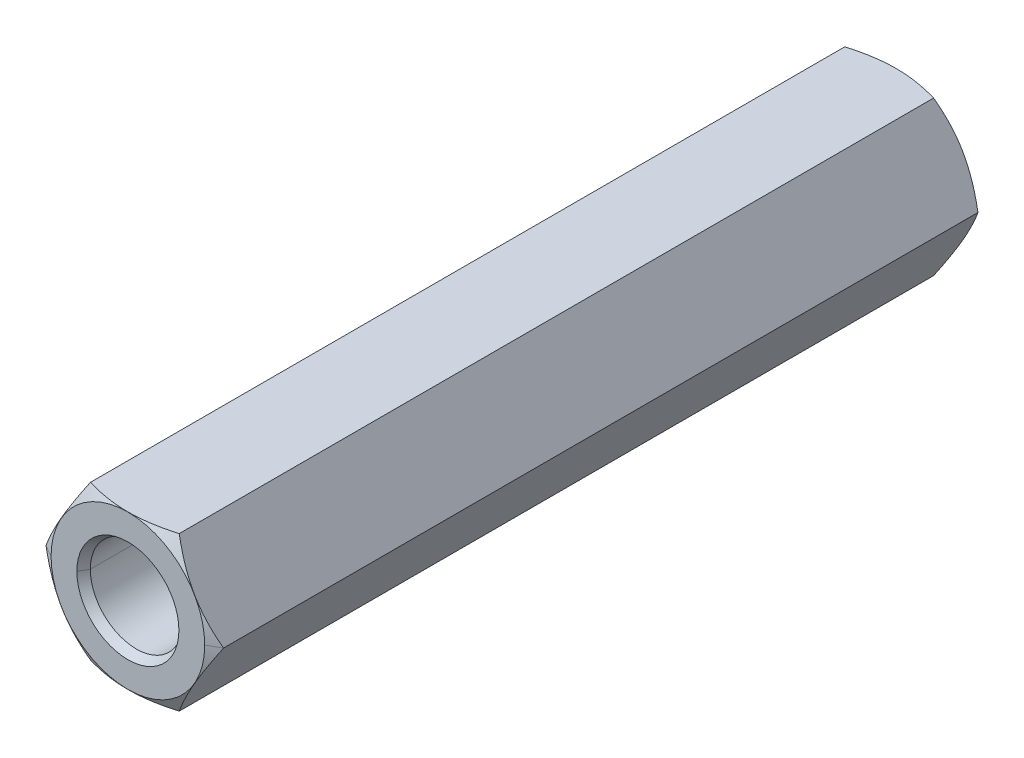
ISO-10303-21;
HEADER;
FILE_DESCRIPTION(('STEP AP214'),'2;1');
FILE_NAME('part.step','',(''),(''),'','','');
FILE_SCHEMA(('AUTOMOTIVE_DESIGN { 1 0 10303 214 1 1 1 1 }'));
ENDSEC;
DATA;
#1=APPLICATION_CONTEXT('core data for automotive mechanical design processes');
#2=APPLICATION_PROTOCOL_DEFINITION('international standard','automotive_design',2000,#1);
#3=PRODUCT_CONTEXT('',#1,'mechanical');
#4=PRODUCT('Part','Part','',(#3));
#5=PRODUCT_RELATED_PRODUCT_CATEGORY('part','',(#4));
#6=PRODUCT_DEFINITION_FORMATION('','',#4);
#7=PRODUCT_DEFINITION_CONTEXT('part definition',#1,'design');
#8=PRODUCT_DEFINITION('design','',#6,#7);
#9=PRODUCT_DEFINITION_SHAPE('','',#8);
#10=(LENGTH_UNIT() NAMED_UNIT(*) SI_UNIT(.MILLI.,.METRE.));
#11=(NAMED_UNIT(*) PLANE_ANGLE_UNIT() SI_UNIT($,.RADIAN.));
#12=(NAMED_UNIT(*) SI_UNIT($,.STERADIAN.) SOLID_ANGLE_UNIT());
#13=UNCERTAINTY_MEASURE_WITH_UNIT(LENGTH_MEASURE(1.E-05),#10,'distance_accuracy_value','');
#14=(GEOMETRIC_REPRESENTATION_CONTEXT(3) GLOBAL_UNCERTAINTY_ASSIGNED_CONTEXT((#13)) GLOBAL_UNIT_ASSIGNED_CONTEXT((#10,
#11,#12)) REPRESENTATION_CONTEXT('',''));
#15=CARTESIAN_POINT('',(0.,0.,0.));
#16=DIRECTION('',(0.,0.,1.));
#17=DIRECTION('',(1.,0.,0.));
#18=AXIS2_PLACEMENT_3D('',#15,#16,#17);
#19=CARTESIAN_POINT('',(116.318744279938,128.56204329235,150.447608312383));
#20=DIRECTION('',(0.,0.,-1.));
#21=DIRECTION('',(1.,0.,0.));
#22=AXIS2_PLACEMENT_3D('',#19,#20,#21);
#23=CONICAL_SURFACE('',#22,1.73205080757048,1.047197551197);
#24=DIRECTION('',(0.86602540378464,0.,-0.499999999999652));
#25=VECTOR('',#24,1.);
#26=CARTESIAN_POINT('',(118.050795087508,128.56204329235,150.447608312383));
#27=LINE('',#26,#25);
#28=CARTESIAN_POINT('',(116.318744279938,128.56204329235,151.447608312383));
#29=VERTEX_POINT('',#28);
#30=CARTESIAN_POINT('',(117.818744279938,128.56204329235,150.581582908599));
#31=VERTEX_POINT('',#30);
#32=EDGE_CURVE('E69',#29,#31,#27,.T.);
#33=ORIENTED_EDGE('',*,*,#32,.F.);
#34=DIRECTION('',(-0.86602540378464,0.,-0.499999999999652));
#35=VECTOR('',#34,1.);
#36=CARTESIAN_POINT('',(114.586693472367,128.56204329235,150.447608312383));
#37=LINE('',#36,#35);
#38=CARTESIAN_POINT('',(114.818744279938,128.56204329235,150.581582908599));
#39=VERTEX_POINT('',#38);
#40=EDGE_CURVE('E11',#29,#39,#37,.T.);
#41=ORIENTED_EDGE('',*,*,#40,.T.);
#42=CARTESIAN_POINT('',(116.318744279938,128.56204329235,150.581582908599));
#43=DIRECTION('',(0.,0.,1.));
#44=DIRECTION('',(1.,0.,0.));
#45=AXIS2_PLACEMENT_3D('',#42,#43,#44);
#46=CIRCLE('',#45,1.5);
#47=EDGE_CURVE('E57',#31,#39,#46,.T.);
#48=ORIENTED_EDGE('',*,*,#47,.F.);
#49=EDGE_LOOP('',(#33,#41,#48));
#50=FACE_BOUND('',#49,.T.);
#51=ADVANCED_FACE('F44',(#50),#23,.F.);
#52=CARTESIAN_POINT('',(116.318744279938,128.56204329235,150.581582908599));
#53=DIRECTION('',(0.,0.,-1.));
#54=DIRECTION('',(1.,0.,0.));
#55=AXIS2_PLACEMENT_3D('',#52,#53,#54);
#56=CYLINDRICAL_SURFACE('',#55,1.5);
#57=ORIENTED_EDGE('',*,*,#47,.T.);
#58=DIRECTION('',(0.,0.,-1.));
#59=VECTOR('',#58,1.);
#60=CARTESIAN_POINT('',(114.818744279938,128.56204329235,150.581582908599));
#61=LINE('',#60,#59);
#62=CARTESIAN_POINT('',(114.818744279938,128.56204329235,140.858711037809));
#63=VERTEX_POINT('',#62);
#64=EDGE_CURVE('E330',#39,#63,#61,.T.);
#65=ORIENTED_EDGE('',*,*,#64,.T.);
#66=CARTESIAN_POINT('',(116.318744279938,128.56204329235,140.858711037809));
#67=DIRECTION('',(0.,0.,1.));
#68=DIRECTION('',(1.,0.,0.));
#69=AXIS2_PLACEMENT_3D('',#66,#67,#68);
#70=CIRCLE('',#69,1.5);
#71=CARTESIAN_POINT('',(117.818744279938,128.56204329235,140.858711037809));
#72=VERTEX_POINT('',#71);
#73=EDGE_CURVE('E343',#72,#63,#70,.T.);
#74=ORIENTED_EDGE('',*,*,#73,.F.);
#75=DIRECTION('',(0.,0.,-1.));
#76=VECTOR('',#75,1.);
#77=CARTESIAN_POINT('',(117.818744279938,128.56204329235,150.581582908599));
#78=LINE('',#77,#76);
#79=EDGE_CURVE('E295',#31,#72,#78,.T.);
#80=ORIENTED_EDGE('',*,*,#79,.F.);
#81=EDGE_LOOP('',(#57,#65,#74,#80));
#82=FACE_BOUND('',#81,.T.);
#83=ADVANCED_FACE('F490',(#82),#56,.F.);
#84=CARTESIAN_POINT('',(116.318744279938,128.56204329235,140.858711037809));
#85=DIRECTION('',(0.,0.,-1.));
#86=DIRECTION('',(1.,0.,0.));
#87=AXIS2_PLACEMENT_3D('',#84,#85,#86);
#88=CONICAL_SURFACE('',#87,1.5,0.5235987756);
#89=ORIENTED_EDGE('',*,*,#73,.T.);
#90=DIRECTION('',(-0.500000000001473,0.,-0.866025403783588));
#91=VECTOR('',#90,1.);
#92=CARTESIAN_POINT('',(114.818744279938,128.56204329235,140.858711037809));
#93=LINE('',#92,#91);
#94=CARTESIAN_POINT('',(114.658744279938,128.56204329235,140.581582908599));
#95=VERTEX_POINT('',#94);
#96=EDGE_CURVE('E269',#63,#95,#93,.T.);
#97=ORIENTED_EDGE('',*,*,#96,.T.);
#98=CARTESIAN_POINT('',(116.318744279938,128.56204329235,140.581582908599));
#99=DIRECTION('',(0.,0.,1.));
#100=DIRECTION('',(1.,0.,0.));
#101=AXIS2_PLACEMENT_3D('',#98,#99,#100);
#102=CIRCLE('',#101,1.66);
#103=CARTESIAN_POINT('',(117.978744279938,128.56204329235,140.581582908599));
#104=VERTEX_POINT('',#103);
#105=EDGE_CURVE('E199',#104,#95,#102,.T.);
#106=ORIENTED_EDGE('',*,*,#105,.F.);
#107=DIRECTION('',(0.500000000001473,0.,-0.866025403783588));
#108=VECTOR('',#107,1.);
#109=CARTESIAN_POINT('',(117.818744279938,128.56204329235,140.858711037809));
#110=LINE('',#109,#108);
#111=EDGE_CURVE('E222',#72,#104,#110,.T.);
#112=ORIENTED_EDGE('',*,*,#111,.F.);
#113=EDGE_LOOP('',(#89,#97,#106,#112));
#114=FACE_BOUND('',#113,.T.);
#115=ADVANCED_FACE('F495',(#114),#88,.F.);
#116=CARTESIAN_POINT('',(116.318744279938,128.56204329235,140.581582908599));
#117=DIRECTION('',(0.,0.,1.));
#118=DIRECTION('',(1.,0.,0.));
#119=AXIS2_PLACEMENT_3D('',#116,#117,#118);
#120=CONICAL_SURFACE('',#119,2.5,1.047197551197);
#121=CARTESIAN_POINT('',(116.318744279938,128.56204329235,140.581582908599));
#122=DIRECTION('',(0.,0.,1.));
#123=DIRECTION('',(1.,0.,0.));
#124=AXIS2_PLACEMENT_3D('',#121,#122,#123);
#125=CIRCLE('',#124,2.5);
#126=CARTESIAN_POINT('',(118.818744279938,128.56204329235,140.581582908599));
#127=VERTEX_POINT('',#126);
#128=CARTESIAN_POINT('',(113.818744279938,128.56204329235,140.581582908599));
#129=VERTEX_POINT('',#128);
#130=EDGE_CURVE('E265',#127,#129,#125,.T.);
#131=ORIENTED_EDGE('',*,*,#130,.T.);
#132=DIRECTION('',(-0.86602540378464,0.,0.499999999999652));
#133=VECTOR('',#132,1.);
#134=CARTESIAN_POINT('',(113.818744279938,128.56204329235,140.581582908599));
#135=LINE('',#134,#133);
#136=CARTESIAN_POINT('',(113.428744279938,128.56204329235,140.806749513583));
#137=VERTEX_POINT('',#136);
#138=EDGE_CURVE('E270',#129,#137,#135,.T.);
#139=ORIENTED_EDGE('',*,*,#138,.T.);
#140=CARTESIAN_POINT('',(114.873744279938,131.064856709287,140.806749513583));
#141=CARTESIAN_POINT('',(114.151244279938,129.813450000819,140.389613944093));
#142=CARTESIAN_POINT('',(113.428744279938,128.56204329235,140.806749513583));
#143=(BOUNDED_CURVE() B_SPLINE_CURVE(2,(#140,#141,#142),.UNSPECIFIED.,.F.,
.F.) B_SPLINE_CURVE_WITH_KNOTS((3,3),(0.,1.),
.UNSPECIFIED.) CURVE() GEOMETRIC_REPRESENTATION_ITEM() RATIONAL_B_SPLINE_CURVE((1.,
1.15470053837935,1.)) REPRESENTATION_ITEM(''));
#144=CARTESIAN_POINT('',(114.873744279938,131.064856709287,140.806749513583));
#145=VERTEX_POINT('',#144);
#146=EDGE_CURVE('E271',#145,#137,#143,.T.);
#147=ORIENTED_EDGE('',*,*,#146,.F.);
#148=CARTESIAN_POINT('',(117.763744279938,131.064856709287,140.806749513583));
#149=CARTESIAN_POINT('',(116.318744279938,131.064856709288,140.389613944093));
#150=CARTESIAN_POINT('',(114.873744279938,131.064856709287,140.806749513583));
#151=(BOUNDED_CURVE() B_SPLINE_CURVE(2,(#148,#149,#150),.UNSPECIFIED.,.F.,
.F.) B_SPLINE_CURVE_WITH_KNOTS((3,3),(0.,1.),
.UNSPECIFIED.) CURVE() GEOMETRIC_REPRESENTATION_ITEM() RATIONAL_B_SPLINE_CURVE((1.,
1.15470053837926,1.)) REPRESENTATION_ITEM(''));
#152=CARTESIAN_POINT('',(117.763744279938,131.064856709287,140.806749513583));
#153=VERTEX_POINT('',#152);
#154=EDGE_CURVE('E48',#153,#145,#151,.T.);
#155=ORIENTED_EDGE('',*,*,#154,.F.);
#156=CARTESIAN_POINT('',(119.208744279938,128.56204329235,140.806749513583));
#157=CARTESIAN_POINT('',(118.486244279938,129.813450000819,140.389613944093));
#158=CARTESIAN_POINT('',(117.763744279938,131.064856709287,140.806749513583));
#159=(BOUNDED_CURVE() B_SPLINE_CURVE(2,(#156,#157,#158),.UNSPECIFIED.,.F.,
.F.) B_SPLINE_CURVE_WITH_KNOTS((3,3),(0.,1.),
.UNSPECIFIED.) CURVE() GEOMETRIC_REPRESENTATION_ITEM() RATIONAL_B_SPLINE_CURVE((1.,
1.15470053837946,1.)) REPRESENTATION_ITEM(''));
#160=CARTESIAN_POINT('',(119.208744279938,128.56204329235,140.806749513583));
#161=VERTEX_POINT('',#160);
#162=EDGE_CURVE('E248',#161,#153,#159,.T.);
#163=ORIENTED_EDGE('',*,*,#162,.F.);
#164=DIRECTION('',(0.86602540378464,0.,0.499999999999652));
#165=VECTOR('',#164,1.);
#166=CARTESIAN_POINT('',(118.818744279938,128.56204329235,140.581582908599));
#167=LINE('',#166,#165);
#168=EDGE_CURVE('E189',#127,#161,#167,.T.);
#169=ORIENTED_EDGE('',*,*,#168,.F.);
#170=EDGE_LOOP('',(#131,#139,#147,#155,#163,#169));
#171=FACE_BOUND('',#170,.T.);
#172=ADVANCED_FACE('F470',(#171),#120,.T.);
#173=CARTESIAN_POINT('',(116.318744279938,128.56204329235,165.356416303615));
#174=DIRECTION('',(0.,0.,-1.));
#175=DIRECTION('',(1.,0.,0.));
#176=AXIS2_PLACEMENT_3D('',#173,#174,#175);
#177=CONICAL_SURFACE('',#176,2.89,1.047197551197);
#178=CARTESIAN_POINT('',(116.318744279938,128.56204329235,165.581582908599));
#179=DIRECTION('',(0.,0.,1.));
#180=DIRECTION('',(1.,0.,0.));
#181=AXIS2_PLACEMENT_3D('',#178,#179,#180);
#182=CIRCLE('',#181,2.5);
#183=CARTESIAN_POINT('',(113.818744279938,128.56204329235,165.581582908599));
#184=VERTEX_POINT('',#183);
#185=CARTESIAN_POINT('',(118.818744279938,128.56204329235,165.581582908599));
#186=VERTEX_POINT('',#185);
#187=EDGE_CURVE('E263',#184,#186,#182,.T.);
#188=ORIENTED_EDGE('',*,*,#187,.F.);
#189=DIRECTION('',(-0.86602540378464,0.,-0.499999999999652));
#190=VECTOR('',#189,1.);
#191=CARTESIAN_POINT('',(113.428744279938,128.56204329235,165.356416303615));
#192=LINE('',#191,#190);
#193=CARTESIAN_POINT('',(113.428744279938,128.56204329235,165.356416303615));
#194=VERTEX_POINT('',#193);
#195=EDGE_CURVE('E195',#184,#194,#192,.T.);
#196=ORIENTED_EDGE('',*,*,#195,.T.);
#197=CARTESIAN_POINT('',(114.873744279938,126.059229875413,165.356416303615));
#198=CARTESIAN_POINT('',(114.151244279938,127.310636583881,165.773551873104));
#199=CARTESIAN_POINT('',(113.428744279938,128.56204329235,165.356416303615));
#200=(BOUNDED_CURVE() B_SPLINE_CURVE(2,(#197,#198,#199),.UNSPECIFIED.,.F.,
.F.) B_SPLINE_CURVE_WITH_KNOTS((3,3),(0.,1.),
.UNSPECIFIED.) CURVE() GEOMETRIC_REPRESENTATION_ITEM() RATIONAL_B_SPLINE_CURVE((1.,
1.15470053837936,1.)) REPRESENTATION_ITEM(''));
#201=CARTESIAN_POINT('',(114.873744279938,126.059229875413,165.356416303615));
#202=VERTEX_POINT('',#201);
#203=EDGE_CURVE('E158',#202,#194,#200,.T.);
#204=ORIENTED_EDGE('',*,*,#203,.F.);
#205=CARTESIAN_POINT('',(117.763744279938,126.059229875413,165.356416303615));
#206=CARTESIAN_POINT('',(116.318744279938,126.059229875413,165.773551873104));
#207=CARTESIAN_POINT('',(114.873744279938,126.059229875413,165.356416303615));
#208=(BOUNDED_CURVE() B_SPLINE_CURVE(2,(#205,#206,#207),.UNSPECIFIED.,.F.,
.F.) B_SPLINE_CURVE_WITH_KNOTS((3,3),(0.,1.),
.UNSPECIFIED.) CURVE() GEOMETRIC_REPRESENTATION_ITEM() RATIONAL_B_SPLINE_CURVE((1.,
1.15470053837925,1.)) REPRESENTATION_ITEM(''));
#209=CARTESIAN_POINT('',(117.763744279938,126.059229875413,165.356416303615));
#210=VERTEX_POINT('',#209);
#211=EDGE_CURVE('E153',#210,#202,#208,.T.);
#212=ORIENTED_EDGE('',*,*,#211,.F.);
#213=CARTESIAN_POINT('',(119.208744279938,128.56204329235,165.356416303615));
#214=CARTESIAN_POINT('',(118.486244279938,127.310636583882,165.773551873105));
#215=CARTESIAN_POINT('',(117.763744279938,126.059229875413,165.356416303615));
#216=(BOUNDED_CURVE() B_SPLINE_CURVE(2,(#213,#214,#215),.UNSPECIFIED.,.F.,
.F.) B_SPLINE_CURVE_WITH_KNOTS((3,3),(0.,1.),
.UNSPECIFIED.) CURVE() GEOMETRIC_REPRESENTATION_ITEM() RATIONAL_B_SPLINE_CURVE((1.,
1.15470053837944,1.)) REPRESENTATION_ITEM(''));
#217=CARTESIAN_POINT('',(119.208744279938,128.56204329235,165.356416303615));
#218=VERTEX_POINT('',#217);
#219=EDGE_CURVE('E231',#218,#210,#216,.T.);
#220=ORIENTED_EDGE('',*,*,#219,.F.);
#221=DIRECTION('',(0.86602540378464,0.,-0.499999999999652));
#222=VECTOR('',#221,1.);
#223=CARTESIAN_POINT('',(119.208744279938,128.56204329235,165.356416303615));
#224=LINE('',#223,#222);
#225=EDGE_CURVE('E256',#186,#218,#224,.T.);
#226=ORIENTED_EDGE('',*,*,#225,.F.);
#227=EDGE_LOOP('',(#188,#196,#204,#212,#220,#226));
#228=FACE_BOUND('',#227,.T.);
#229=ADVANCED_FACE('F530',(#228),#177,.T.);
#230=CARTESIAN_POINT('',(116.318744279938,128.56204329235,165.581582908599));
#231=DIRECTION('',(0.,0.,1.));
#232=DIRECTION('',(1.,0.,0.));
#233=AXIS2_PLACEMENT_3D('',#230,#231,#232);
#234=CONICAL_SURFACE('',#233,1.65999999999899,0.523598775598);
#235=CARTESIAN_POINT('',(116.318744279938,128.56204329235,165.304454779388));
#236=DIRECTION('',(0.,0.,1.));
#237=DIRECTION('',(1.,0.,0.));
#238=AXIS2_PLACEMENT_3D('',#235,#236,#237);
#239=CIRCLE('',#238,1.5);
#240=CARTESIAN_POINT('',(114.818744279938,128.56204329235,165.304454779388));
#241=VERTEX_POINT('',#240);
#242=CARTESIAN_POINT('',(117.818744279938,128.56204329235,165.304454779388));
#243=VERTEX_POINT('',#242);
#244=EDGE_CURVE('E344',#241,#243,#239,.T.);
#245=ORIENTED_EDGE('',*,*,#244,.F.);
#246=DIRECTION('',(-0.499999999999741,0.,0.866025403784588));
#247=VECTOR('',#246,1.);
#248=CARTESIAN_POINT('',(114.658744279939,128.56204329235,165.581582908599));
#249=LINE('',#248,#247);
#250=CARTESIAN_POINT('',(114.658744279939,128.56204329235,165.581582908599));
#251=VERTEX_POINT('',#250);
#252=EDGE_CURVE('E190',#241,#251,#249,.T.);
#253=ORIENTED_EDGE('',*,*,#252,.T.);
#254=CARTESIAN_POINT('',(116.318744279938,128.56204329235,165.581582908599));
#255=DIRECTION('',(0.,0.,1.));
#256=DIRECTION('',(1.,0.,0.));
#257=AXIS2_PLACEMENT_3D('',#254,#255,#256);
#258=CIRCLE('',#257,1.65999999999899);
#259=CARTESIAN_POINT('',(117.978744279937,128.56204329235,165.581582908599));
#260=VERTEX_POINT('',#259);
#261=EDGE_CURVE('E196',#251,#260,#258,.T.);
#262=ORIENTED_EDGE('',*,*,#261,.T.);
#263=DIRECTION('',(0.499999999999741,0.,0.866025403784588));
#264=VECTOR('',#263,1.);
#265=CARTESIAN_POINT('',(117.978744279937,128.56204329235,165.581582908599));
#266=LINE('',#265,#264);
#267=EDGE_CURVE('E233',#243,#260,#266,.T.);
#268=ORIENTED_EDGE('',*,*,#267,.F.);
#269=EDGE_LOOP('',(#245,#253,#262,#268));
#270=FACE_BOUND('',#269,.T.);
#271=ADVANCED_FACE('F528',(#270),#234,.F.);
#272=CARTESIAN_POINT('',(116.318744279938,128.56204329235,165.304454779388));
#273=DIRECTION('',(0.,0.,-1.));
#274=DIRECTION('',(1.,0.,0.));
#275=AXIS2_PLACEMENT_3D('',#272,#273,#274);
#276=CYLINDRICAL_SURFACE('',#275,1.5);
#277=CARTESIAN_POINT('',(116.318744279938,128.56204329235,165.304454779388));
#278=DIRECTION('',(0.,0.,1.));
#279=DIRECTION('',(1.,0.,0.));
#280=AXIS2_PLACEMENT_3D('',#277,#278,#279);
#281=CIRCLE('',#280,1.5);
#282=EDGE_CURVE('E352',#243,#241,#281,.T.);
#283=ORIENTED_EDGE('',*,*,#282,.T.);
#284=DIRECTION('',(0.,0.,-1.));
#285=VECTOR('',#284,1.);
#286=CARTESIAN_POINT('',(114.818744279938,128.56204329235,165.304454779388));
#287=LINE('',#286,#285);
#288=CARTESIAN_POINT('',(114.818744279938,128.56204329235,155.581582908599));
#289=VERTEX_POINT('',#288);
#290=EDGE_CURVE('E226',#241,#289,#287,.T.);
#291=ORIENTED_EDGE('',*,*,#290,.T.);
#292=CARTESIAN_POINT('',(116.318744279938,128.56204329235,155.581582908599));
#293=DIRECTION('',(0.,0.,1.));
#294=DIRECTION('',(1.,0.,0.));
#295=AXIS2_PLACEMENT_3D('',#292,#293,#294);
#296=CIRCLE('',#295,1.5);
#297=CARTESIAN_POINT('',(117.818744279938,128.56204329235,155.581582908599));
#298=VERTEX_POINT('',#297);
#299=EDGE_CURVE('E348',#298,#289,#296,.T.);
#300=ORIENTED_EDGE('',*,*,#299,.F.);
#301=DIRECTION('',(0.,0.,-1.));
#302=VECTOR('',#301,1.);
#303=CARTESIAN_POINT('',(117.818744279938,128.56204329235,165.304454779388));
#304=LINE('',#303,#302);
#305=EDGE_CURVE('E240',#243,#298,#304,.T.);
#306=ORIENTED_EDGE('',*,*,#305,.F.);
#307=EDGE_LOOP('',(#283,#291,#300,#306));
#308=FACE_BOUND('',#307,.T.);
#309=ADVANCED_FACE('F46',(#308),#276,.F.);
#310=CARTESIAN_POINT('',(116.318744279938,128.56204329235,155.581582908599));
#311=DIRECTION('',(0.,0.,1.));
#312=DIRECTION('',(1.,0.,0.));
#313=AXIS2_PLACEMENT_3D('',#310,#311,#312);
#314=CONICAL_SURFACE('',#313,1.5,1.047197551197);
#315=DIRECTION('',(0.86602540378464,0.,0.499999999999652));
#316=VECTOR('',#315,1.);
#317=CARTESIAN_POINT('',(117.818744279938,128.56204329235,155.581582908599));
#318=LINE('',#317,#316);
#319=CARTESIAN_POINT('',(116.318744279938,128.56204329235,154.715557504813));
#320=VERTEX_POINT('',#319);
#321=EDGE_CURVE('E318',#320,#298,#318,.T.);
#322=ORIENTED_EDGE('',*,*,#321,.F.);
#323=DIRECTION('',(-0.86602540378464,0.,0.499999999999652));
#324=VECTOR('',#323,1.);
#325=CARTESIAN_POINT('',(114.818744279938,128.56204329235,155.581582908599));
#326=LINE('',#325,#324);
#327=EDGE_CURVE('E317',#320,#289,#326,.T.);
#328=ORIENTED_EDGE('',*,*,#327,.T.);
#329=CARTESIAN_POINT('',(116.318744279938,128.56204329235,155.581582908599));
#330=DIRECTION('',(0.,0.,1.));
#331=DIRECTION('',(1.,0.,0.));
#332=AXIS2_PLACEMENT_3D('',#329,#330,#331);
#333=CIRCLE('',#332,1.5);
#334=EDGE_CURVE('E313',#289,#298,#333,.T.);
#335=ORIENTED_EDGE('',*,*,#334,.T.);
#336=EDGE_LOOP('',(#322,#328,#335));
#337=FACE_BOUND('',#336,.T.);
#338=ADVANCED_FACE('F400',(#337),#314,.F.);
#339=CARTESIAN_POINT('',(116.318744279938,128.56204329235,155.581582908599));
#340=DIRECTION('',(0.,0.,1.));
#341=DIRECTION('',(1.,0.,0.));
#342=AXIS2_PLACEMENT_3D('',#339,#340,#341);
#343=CONICAL_SURFACE('',#342,1.5,1.047197551197);
#344=ORIENTED_EDGE('',*,*,#327,.F.);
#345=ORIENTED_EDGE('',*,*,#321,.T.);
#346=ORIENTED_EDGE('',*,*,#299,.T.);
#347=EDGE_LOOP('',(#344,#345,#346));
#348=FACE_BOUND('',#347,.T.);
#349=ADVANCED_FACE('F394',(#348),#343,.F.);
#350=CARTESIAN_POINT('',(116.318744279938,128.56204329235,165.304454779388));
#351=DIRECTION('',(0.,0.,-1.));
#352=DIRECTION('',(1.,0.,0.));
#353=AXIS2_PLACEMENT_3D('',#350,#351,#352);
#354=CYLINDRICAL_SURFACE('',#353,1.5);
#355=ORIENTED_EDGE('',*,*,#290,.F.);
#356=ORIENTED_EDGE('',*,*,#244,.T.);
#357=ORIENTED_EDGE('',*,*,#305,.T.);
#358=ORIENTED_EDGE('',*,*,#334,.F.);
#359=EDGE_LOOP('',(#355,#356,#357,#358));
#360=FACE_BOUND('',#359,.T.);
#361=ADVANCED_FACE('F404',(#360),#354,.F.);
#362=CARTESIAN_POINT('',(116.318744279938,128.56204329235,165.581582908599));
#363=DIRECTION('',(0.,0.,1.));
#364=DIRECTION('',(1.,0.,0.));
#365=AXIS2_PLACEMENT_3D('',#362,#363,#364);
#366=CONICAL_SURFACE('',#365,1.65999999999899,0.523598775598);
#367=ORIENTED_EDGE('',*,*,#252,.F.);
#368=ORIENTED_EDGE('',*,*,#282,.F.);
#369=ORIENTED_EDGE('',*,*,#267,.T.);
#370=CARTESIAN_POINT('',(116.318744279938,128.56204329235,165.581582908599));
#371=DIRECTION('',(0.,0.,1.));
#372=DIRECTION('',(1.,0.,0.));
#373=AXIS2_PLACEMENT_3D('',#370,#371,#372);
#374=CIRCLE('',#373,1.65999999999899);
#375=EDGE_CURVE('E241',#260,#251,#374,.T.);
#376=ORIENTED_EDGE('',*,*,#375,.T.);
#377=EDGE_LOOP('',(#367,#368,#369,#376));
#378=FACE_BOUND('',#377,.T.);
#379=ADVANCED_FACE('F511',(#378),#366,.F.);
#380=CARTESIAN_POINT('',(116.318744279938,128.56204329235,165.581582908599));
#381=DIRECTION('',(0.,0.,1.));
#382=DIRECTION('',(1.,0.,0.));
#383=AXIS2_PLACEMENT_3D('',#380,#381,#382);
#384=PLANE('',#383);
#385=CARTESIAN_POINT('',(116.318744279938,128.56204329235,165.581582908599));
#386=DIRECTION('',(0.,0.,1.));
#387=DIRECTION('',(1.,0.,0.));
#388=AXIS2_PLACEMENT_3D('',#385,#386,#387);
#389=CIRCLE('',#388,2.5);
#390=EDGE_CURVE('E311',#186,#184,#389,.T.);
#391=ORIENTED_EDGE('',*,*,#390,.T.);
#392=ORIENTED_EDGE('',*,*,#187,.T.);
#393=EDGE_LOOP('',(#391,#392));
#394=FACE_BOUND('',#393,.T.);
#395=ORIENTED_EDGE('',*,*,#375,.F.);
#396=ORIENTED_EDGE('',*,*,#261,.F.);
#397=EDGE_LOOP('',(#395,#396));
#398=FACE_BOUND('',#397,.T.);
#399=ADVANCED_FACE('F514',(#394,#398),#384,.T.);
#400=CARTESIAN_POINT('',(116.318744279938,128.56204329235,165.356416303615));
#401=DIRECTION('',(0.,0.,-1.));
#402=DIRECTION('',(1.,0.,0.));
#403=AXIS2_PLACEMENT_3D('',#400,#401,#402);
#404=CONICAL_SURFACE('',#403,2.89,1.047197551197);
#405=ORIENTED_EDGE('',*,*,#195,.F.);
#406=ORIENTED_EDGE('',*,*,#390,.F.);
#407=ORIENTED_EDGE('',*,*,#225,.T.);
#408=CARTESIAN_POINT('',(117.763744279938,131.064856709287,165.356416303615));
#409=CARTESIAN_POINT('',(118.486244279938,129.813450000819,165.773551873104));
#410=CARTESIAN_POINT('',(119.208744279938,128.56204329235,165.356416303615));
#411=(BOUNDED_CURVE() B_SPLINE_CURVE(2,(#408,#409,#410),.UNSPECIFIED.,.F.,
.F.) B_SPLINE_CURVE_WITH_KNOTS((3,3),(0.,1.),
.UNSPECIFIED.) CURVE() GEOMETRIC_REPRESENTATION_ITEM() RATIONAL_B_SPLINE_CURVE((1.,
1.15470053837935,1.)) REPRESENTATION_ITEM(''));
#412=CARTESIAN_POINT('',(117.763744279938,131.064856709287,165.356416303615));
#413=VERTEX_POINT('',#412);
#414=EDGE_CURVE('E242',#413,#218,#411,.T.);
#415=ORIENTED_EDGE('',*,*,#414,.F.);
#416=CARTESIAN_POINT('',(114.873744279938,131.064856709287,165.356416303615));
#417=CARTESIAN_POINT('',(116.318744279938,131.064856709287,165.773551873104));
#418=CARTESIAN_POINT('',(117.763744279938,131.064856709287,165.356416303615));
#419=(BOUNDED_CURVE() B_SPLINE_CURVE(2,(#416,#417,#418),.UNSPECIFIED.,.F.,
.F.) B_SPLINE_CURVE_WITH_KNOTS((3,3),(0.,1.),
.UNSPECIFIED.) CURVE() GEOMETRIC_REPRESENTATION_ITEM() RATIONAL_B_SPLINE_CURVE((1.,
1.15470053837925,1.)) REPRESENTATION_ITEM(''));
#420=CARTESIAN_POINT('',(114.873744279938,131.064856709287,165.356416303615));
#421=VERTEX_POINT('',#420);
#422=EDGE_CURVE('E356',#421,#413,#419,.T.);
#423=ORIENTED_EDGE('',*,*,#422,.F.);
#424=CARTESIAN_POINT('',(113.428744279938,128.56204329235,165.356416303615));
#425=CARTESIAN_POINT('',(114.151244279937,129.813450000819,165.773551873104));
#426=CARTESIAN_POINT('',(114.873744279938,131.064856709287,165.356416303615));
#427=(BOUNDED_CURVE() B_SPLINE_CURVE(2,(#424,#425,#426),.UNSPECIFIED.,.F.,
.F.) B_SPLINE_CURVE_WITH_KNOTS((3,3),(0.,1.),
.UNSPECIFIED.) CURVE() GEOMETRIC_REPRESENTATION_ITEM() RATIONAL_B_SPLINE_CURVE((1.,
1.15470053837944,1.)) REPRESENTATION_ITEM(''));
#428=EDGE_CURVE('E183',#194,#421,#427,.T.);
#429=ORIENTED_EDGE('',*,*,#428,.F.);
#430=EDGE_LOOP('',(#405,#406,#407,#415,#423,#429));
#431=FACE_BOUND('',#430,.T.);
#432=ADVANCED_FACE('F476',(#431),#404,.T.);
#433=CARTESIAN_POINT('',(117.763744279938,126.059229875413,140.581582908599));
#434=DIRECTION('',(-0.866025403784329,0.50000000000019,0.));
#435=DIRECTION('',(0.,0.,1.));
#436=AXIS2_PLACEMENT_3D('',#433,#434,#435);
#437=PLANE('',#436);
#438=DIRECTION('',(0.,0.,1.));
#439=VECTOR('',#438,1.);
#440=CARTESIAN_POINT('',(119.208744279938,128.56204329235,140.806749513583));
#441=LINE('',#440,#439);
#442=EDGE_CURVE('E264',#161,#218,#441,.T.);
#443=ORIENTED_EDGE('',*,*,#442,.T.);
#444=ORIENTED_EDGE('',*,*,#219,.T.);
#445=DIRECTION('',(0.,0.,1.));
#446=VECTOR('',#445,1.);
#447=CARTESIAN_POINT('',(117.763744279938,126.059229875413,140.581582908599));
#448=LINE('',#447,#446);
#449=CARTESIAN_POINT('',(117.763744279938,126.059229875413,140.806749513583));
#450=VERTEX_POINT('',#449);
#451=EDGE_CURVE('E232',#450,#210,#448,.T.);
#452=ORIENTED_EDGE('',*,*,#451,.F.);
#453=CARTESIAN_POINT('',(117.763744279938,126.059229875413,140.806749513583));
#454=CARTESIAN_POINT('',(118.486244279938,127.310636583881,140.389613944093));
#455=CARTESIAN_POINT('',(119.208744279938,128.56204329235,140.806749513583));
#456=(BOUNDED_CURVE() B_SPLINE_CURVE(2,(#453,#454,#455),.UNSPECIFIED.,.F.,
.F.) B_SPLINE_CURVE_WITH_KNOTS((3,3),(0.,1.),
.UNSPECIFIED.) CURVE() GEOMETRIC_REPRESENTATION_ITEM() RATIONAL_B_SPLINE_CURVE((1.,
1.15470053837935,1.)) REPRESENTATION_ITEM(''));
#457=EDGE_CURVE('E167',#450,#161,#456,.T.);
#458=ORIENTED_EDGE('',*,*,#457,.T.);
#459=EDGE_LOOP('',(#443,#444,#452,#458));
#460=FACE_BOUND('',#459,.T.);
#461=ADVANCED_FACE('F518',(#460),#437,.F.);
#462=CARTESIAN_POINT('',(114.873744279938,126.059229875413,140.581582908599));
#463=DIRECTION('',(0.,1.,0.));
#464=DIRECTION('',(1.,0.,0.));
#465=AXIS2_PLACEMENT_3D('',#462,#463,#464);
#466=PLANE('',#465);
#467=ORIENTED_EDGE('',*,*,#451,.T.);
#468=ORIENTED_EDGE('',*,*,#211,.T.);
#469=DIRECTION('',(0.,0.,1.));
#470=VECTOR('',#469,1.);
#471=CARTESIAN_POINT('',(114.873744279938,126.059229875413,140.581582908599));
#472=LINE('',#471,#470);
#473=CARTESIAN_POINT('',(114.873744279938,126.059229875413,140.806749513583));
#474=VERTEX_POINT('',#473);
#475=EDGE_CURVE('E147',#474,#202,#472,.T.);
#476=ORIENTED_EDGE('',*,*,#475,.F.);
#477=CARTESIAN_POINT('',(114.873744279938,126.059229875413,140.806749513583));
#478=CARTESIAN_POINT('',(116.318744279938,126.059229875413,140.389613944093));
#479=CARTESIAN_POINT('',(117.763744279938,126.059229875413,140.806749513583));
#480=(BOUNDED_CURVE() B_SPLINE_CURVE(2,(#477,#478,#479),.UNSPECIFIED.,.F.,
.F.) B_SPLINE_CURVE_WITH_KNOTS((3,3),(0.,1.),
.UNSPECIFIED.) CURVE() GEOMETRIC_REPRESENTATION_ITEM() RATIONAL_B_SPLINE_CURVE((1.,
1.15470053837926,1.)) REPRESENTATION_ITEM(''));
#481=EDGE_CURVE('E151',#474,#450,#480,.T.);
#482=ORIENTED_EDGE('',*,*,#481,.T.);
#483=EDGE_LOOP('',(#467,#468,#476,#482));
#484=FACE_BOUND('',#483,.T.);
#485=ADVANCED_FACE('F150',(#484),#466,.F.);
#486=CARTESIAN_POINT('',(113.428744279938,128.56204329235,140.581582908599));
#487=DIRECTION('',(0.866025403784329,0.50000000000019,0.));
#488=DIRECTION('',(0.,0.,-1.));
#489=AXIS2_PLACEMENT_3D('',#486,#487,#488);
#490=PLANE('',#489);
#491=ORIENTED_EDGE('',*,*,#475,.T.);
#492=ORIENTED_EDGE('',*,*,#203,.T.);
#493=DIRECTION('',(0.,0.,1.));
#494=VECTOR('',#493,1.);
#495=CARTESIAN_POINT('',(113.428744279938,128.56204329235,140.581582908599));
#496=LINE('',#495,#494);
#497=EDGE_CURVE('E173',#137,#194,#496,.T.);
#498=ORIENTED_EDGE('',*,*,#497,.F.);
#499=CARTESIAN_POINT('',(113.428744279938,128.56204329235,140.806749513583));
#500=CARTESIAN_POINT('',(114.151244279937,127.310636583882,140.389613944093));
#501=CARTESIAN_POINT('',(114.873744279938,126.059229875413,140.806749513583));
#502=(BOUNDED_CURVE() B_SPLINE_CURVE(2,(#499,#500,#501),.UNSPECIFIED.,.F.,
.F.) B_SPLINE_CURVE_WITH_KNOTS((3,3),(0.,1.),
.UNSPECIFIED.) CURVE() GEOMETRIC_REPRESENTATION_ITEM() RATIONAL_B_SPLINE_CURVE((1.,
1.15470053837945,1.)) REPRESENTATION_ITEM(''));
#503=EDGE_CURVE('E165',#137,#474,#502,.T.);
#504=ORIENTED_EDGE('',*,*,#503,.T.);
#505=EDGE_LOOP('',(#491,#492,#498,#504));
#506=FACE_BOUND('',#505,.T.);
#507=ADVANCED_FACE('F171',(#506),#490,.F.);
#508=CARTESIAN_POINT('',(114.873744279938,131.064856709287,140.581582908599));
#509=DIRECTION('',(0.866025403784329,-0.50000000000019,0.));
#510=DIRECTION('',(0.,0.,-1.));
#511=AXIS2_PLACEMENT_3D('',#508,#509,#510);
#512=PLANE('',#511);
#513=ORIENTED_EDGE('',*,*,#497,.T.);
#514=ORIENTED_EDGE('',*,*,#428,.T.);
#515=DIRECTION('',(0.,0.,1.));
#516=VECTOR('',#515,1.);
#517=CARTESIAN_POINT('',(114.873744279938,131.064856709287,140.581582908599));
#518=LINE('',#517,#516);
#519=EDGE_CURVE('E277',#145,#421,#518,.T.);
#520=ORIENTED_EDGE('',*,*,#519,.F.);
#521=ORIENTED_EDGE('',*,*,#146,.T.);
#522=EDGE_LOOP('',(#513,#514,#520,#521));
#523=FACE_BOUND('',#522,.T.);
#524=ADVANCED_FACE('F478',(#523),#512,.F.);
#525=CARTESIAN_POINT('',(117.763744279938,131.064856709287,140.581582908599));
#526=DIRECTION('',(0.,-1.,0.));
#527=DIRECTION('',(-1.,0.,0.));
#528=AXIS2_PLACEMENT_3D('',#525,#526,#527);
#529=PLANE('',#528);
#530=ORIENTED_EDGE('',*,*,#519,.T.);
#531=ORIENTED_EDGE('',*,*,#422,.T.);
#532=DIRECTION('',(0.,0.,1.));
#533=VECTOR('',#532,1.);
#534=CARTESIAN_POINT('',(117.763744279938,131.064856709287,140.581582908599));
#535=LINE('',#534,#533);
#536=EDGE_CURVE('E247',#153,#413,#535,.T.);
#537=ORIENTED_EDGE('',*,*,#536,.F.);
#538=ORIENTED_EDGE('',*,*,#154,.T.);
#539=EDGE_LOOP('',(#530,#531,#537,#538));
#540=FACE_BOUND('',#539,.T.);
#541=ADVANCED_FACE('F473',(#540),#529,.F.);
#542=CARTESIAN_POINT('',(119.208744279938,128.56204329235,140.581582908599));
#543=DIRECTION('',(-0.866025403784329,-0.50000000000019,0.));
#544=DIRECTION('',(-0.50000000000019,0.866025403784329,0.));
#545=AXIS2_PLACEMENT_3D('',#542,#543,#544);
#546=PLANE('',#545);
#547=ORIENTED_EDGE('',*,*,#536,.T.);
#548=ORIENTED_EDGE('',*,*,#414,.T.);
#549=ORIENTED_EDGE('',*,*,#442,.F.);
#550=ORIENTED_EDGE('',*,*,#162,.T.);
#551=EDGE_LOOP('',(#547,#548,#549,#550));
#552=FACE_BOUND('',#551,.T.);
#553=ADVANCED_FACE('F466',(#552),#546,.F.);
#554=CARTESIAN_POINT('',(116.318744279938,128.56204329235,140.581582908599));
#555=DIRECTION('',(0.,0.,1.));
#556=DIRECTION('',(1.,0.,0.));
#557=AXIS2_PLACEMENT_3D('',#554,#555,#556);
#558=CONICAL_SURFACE('',#557,2.5,1.047197551197);
#559=ORIENTED_EDGE('',*,*,#138,.F.);
#560=CARTESIAN_POINT('',(116.318744279938,128.56204329235,140.581582908599));
#561=DIRECTION('',(0.,0.,1.));
#562=DIRECTION('',(1.,0.,0.));
#563=AXIS2_PLACEMENT_3D('',#560,#561,#562);
#564=CIRCLE('',#563,2.5);
#565=EDGE_CURVE('E212',#129,#127,#564,.T.);
#566=ORIENTED_EDGE('',*,*,#565,.T.);
#567=ORIENTED_EDGE('',*,*,#168,.T.);
#568=ORIENTED_EDGE('',*,*,#457,.F.);
#569=ORIENTED_EDGE('',*,*,#481,.F.);
#570=ORIENTED_EDGE('',*,*,#503,.F.);
#571=EDGE_LOOP('',(#559,#566,#567,#568,#569,#570));
#572=FACE_BOUND('',#571,.T.);
#573=ADVANCED_FACE('F164',(#572),#558,.T.);
#574=CARTESIAN_POINT('',(116.318744279938,128.56204329235,140.581582908599));
#575=DIRECTION('',(0.,0.,1.));
#576=DIRECTION('',(1.,0.,0.));
#577=AXIS2_PLACEMENT_3D('',#574,#575,#576);
#578=PLANE('',#577);
#579=ORIENTED_EDGE('',*,*,#130,.F.);
#580=ORIENTED_EDGE('',*,*,#565,.F.);
#581=EDGE_LOOP('',(#579,#580));
#582=FACE_BOUND('',#581,.T.);
#583=ORIENTED_EDGE('',*,*,#105,.T.);
#584=CARTESIAN_POINT('',(116.318744279938,128.56204329235,140.581582908599));
#585=DIRECTION('',(0.,0.,1.));
#586=DIRECTION('',(1.,0.,0.));
#587=AXIS2_PLACEMENT_3D('',#584,#585,#586);
#588=CIRCLE('',#587,1.66);
#589=EDGE_CURVE('E205',#95,#104,#588,.T.);
#590=ORIENTED_EDGE('',*,*,#589,.T.);
#591=EDGE_LOOP('',(#583,#590));
#592=FACE_BOUND('',#591,.T.);
#593=ADVANCED_FACE('F427',(#582,#592),#578,.F.);
#594=CARTESIAN_POINT('',(116.318744279938,128.56204329235,140.858711037809));
#595=DIRECTION('',(0.,0.,-1.));
#596=DIRECTION('',(1.,0.,0.));
#597=AXIS2_PLACEMENT_3D('',#594,#595,#596);
#598=CONICAL_SURFACE('',#597,1.5,0.5235987756);
#599=ORIENTED_EDGE('',*,*,#96,.F.);
#600=CARTESIAN_POINT('',(116.318744279938,128.56204329235,140.858711037809));
#601=DIRECTION('',(0.,0.,1.));
#602=DIRECTION('',(1.,0.,0.));
#603=AXIS2_PLACEMENT_3D('',#600,#601,#602);
#604=CIRCLE('',#603,1.5);
#605=EDGE_CURVE('E214',#63,#72,#604,.T.);
#606=ORIENTED_EDGE('',*,*,#605,.T.);
#607=ORIENTED_EDGE('',*,*,#111,.T.);
#608=ORIENTED_EDGE('',*,*,#589,.F.);
#609=EDGE_LOOP('',(#599,#606,#607,#608));
#610=FACE_BOUND('',#609,.T.);
#611=ADVANCED_FACE('F502',(#610),#598,.F.);
#612=CARTESIAN_POINT('',(116.318744279938,128.56204329235,150.581582908599));
#613=DIRECTION('',(0.,0.,-1.));
#614=DIRECTION('',(1.,0.,0.));
#615=AXIS2_PLACEMENT_3D('',#612,#613,#614);
#616=CYLINDRICAL_SURFACE('',#615,1.5);
#617=ORIENTED_EDGE('',*,*,#64,.F.);
#618=CARTESIAN_POINT('',(116.318744279938,128.56204329235,150.581582908599));
#619=DIRECTION('',(0.,0.,1.));
#620=DIRECTION('',(1.,0.,0.));
#621=AXIS2_PLACEMENT_3D('',#618,#619,#620);
#622=CIRCLE('',#621,1.5);
#623=EDGE_CURVE('E288',#39,#31,#622,.T.);
#624=ORIENTED_EDGE('',*,*,#623,.T.);
#625=ORIENTED_EDGE('',*,*,#79,.T.);
#626=ORIENTED_EDGE('',*,*,#605,.F.);
#627=EDGE_LOOP('',(#617,#624,#625,#626));
#628=FACE_BOUND('',#627,.T.);
#629=ADVANCED_FACE('F505',(#628),#616,.F.);
#630=CARTESIAN_POINT('',(116.318744279938,128.56204329235,150.447608312383));
#631=DIRECTION('',(0.,0.,-1.));
#632=DIRECTION('',(1.,0.,0.));
#633=AXIS2_PLACEMENT_3D('',#630,#631,#632);
#634=CONICAL_SURFACE('',#633,1.73205080757048,1.047197551197);
#635=ORIENTED_EDGE('',*,*,#40,.F.);
#636=ORIENTED_EDGE('',*,*,#32,.T.);
#637=ORIENTED_EDGE('',*,*,#623,.F.);
#638=EDGE_LOOP('',(#635,#636,#637));
#639=FACE_BOUND('',#638,.T.);
#640=ADVANCED_FACE('F508',(#639),#634,.F.);
#641=CLOSED_SHELL('',(#51,#83,#115,#172,#229,#271,#309,#338,#349,#361,#379,#399,#432,#461,#485,
#507,#524,#541,#553,#573,#593,#611,#629,#640));
#642=MANIFOLD_SOLID_BREP('B2',#641);
#643=ADVANCED_BREP_SHAPE_REPRESENTATION('',(#18,#642),#14);
#644=SHAPE_DEFINITION_REPRESENTATION(#9,#643);
ENDSEC;
END-ISO-10303-21;
